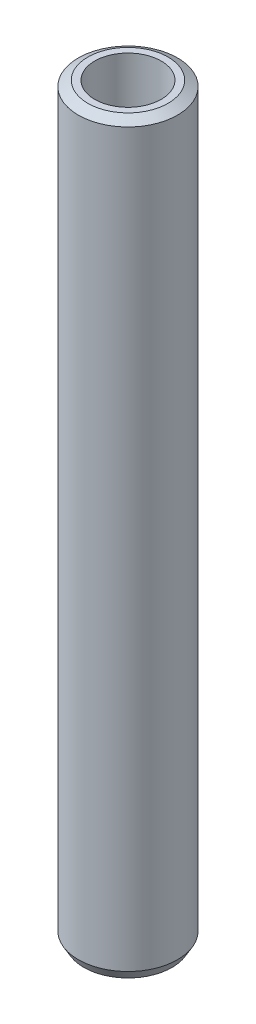
ISO-10303-21;
HEADER;
FILE_DESCRIPTION(('STEP AP214'),'2;1');
FILE_NAME('part.step','',(''),(''),'','','');
FILE_SCHEMA(('AUTOMOTIVE_DESIGN { 1 0 10303 214 1 1 1 1 }'));
ENDSEC;
DATA;
#1=APPLICATION_CONTEXT('core data for automotive mechanical design processes');
#2=APPLICATION_PROTOCOL_DEFINITION('international standard','automotive_design',2000,#1);
#3=PRODUCT_CONTEXT('',#1,'mechanical');
#4=PRODUCT('Part','Part','',(#3));
#5=PRODUCT_RELATED_PRODUCT_CATEGORY('part','',(#4));
#6=PRODUCT_DEFINITION_FORMATION('','',#4);
#7=PRODUCT_DEFINITION_CONTEXT('part definition',#1,'design');
#8=PRODUCT_DEFINITION('design','',#6,#7);
#9=PRODUCT_DEFINITION_SHAPE('','',#8);
#10=(LENGTH_UNIT() NAMED_UNIT(*) SI_UNIT(.MILLI.,.METRE.));
#11=(NAMED_UNIT(*) PLANE_ANGLE_UNIT() SI_UNIT($,.RADIAN.));
#12=(NAMED_UNIT(*) SI_UNIT($,.STERADIAN.) SOLID_ANGLE_UNIT());
#13=UNCERTAINTY_MEASURE_WITH_UNIT(LENGTH_MEASURE(1.E-05),#10,'distance_accuracy_value','');
#14=(GEOMETRIC_REPRESENTATION_CONTEXT(3) GLOBAL_UNCERTAINTY_ASSIGNED_CONTEXT((#13)) GLOBAL_UNIT_ASSIGNED_CONTEXT((#10,
#11,#12)) REPRESENTATION_CONTEXT('',''));
#15=CARTESIAN_POINT('',(0.,0.,0.));
#16=DIRECTION('',(0.,0.,1.));
#17=DIRECTION('',(1.,0.,0.));
#18=AXIS2_PLACEMENT_3D('',#15,#16,#17);
#19=CARTESIAN_POINT('',(0.,413.705561087987,0.));
#20=DIRECTION('',(0.,-1.,0.));
#21=DIRECTION('',(0.,0.,-1.));
#22=AXIS2_PLACEMENT_3D('',#19,#20,#21);
#23=CYLINDRICAL_SURFACE('',#22,27.5);
#24=CARTESIAN_POINT('',(0.,410.66934322682,0.));
#25=DIRECTION('',(0.,1.,0.));
#26=DIRECTION('',(0.,0.,1.));
#27=AXIS2_PLACEMENT_3D('',#24,#25,#26);
#28=CIRCLE('',#27,27.5);
#29=CARTESIAN_POINT('',(0.,410.66934322682,27.5));
#30=VERTEX_POINT('',#29);
#31=EDGE_CURVE('E50',#30,#30,#28,.F.);
#32=ORIENTED_EDGE('',*,*,#31,.T.);
#33=EDGE_LOOP('',(#32));
#34=FACE_BOUND('',#33,.T.);
#35=CARTESIAN_POINT('',(0.,5.25888359838927,0.));
#36=DIRECTION('',(0.,1.,0.));
#37=DIRECTION('',(0.,0.,1.));
#38=AXIS2_PLACEMENT_3D('',#35,#36,#37);
#39=CIRCLE('',#38,27.5);
#40=CARTESIAN_POINT('',(0.,5.25888359838927,27.5));
#41=VERTEX_POINT('',#40);
#42=EDGE_CURVE('E51',#41,#41,#39,.T.);
#43=ORIENTED_EDGE('',*,*,#42,.T.);
#44=EDGE_LOOP('',(#43));
#45=FACE_BOUND('',#44,.T.);
#46=ADVANCED_FACE('F39',(#34,#45),#23,.T.);
#47=CARTESIAN_POINT('',(0.,413.705561087987,0.));
#48=DIRECTION('',(0.,1.,0.));
#49=DIRECTION('',(0.,0.,1.));
#50=AXIS2_PLACEMENT_3D('',#47,#48,#49);
#51=PLANE('',#50);
#52=CARTESIAN_POINT('',(0.,413.705561087987,0.));
#53=DIRECTION('',(0.,1.,0.));
#54=DIRECTION('',(0.,0.,1.));
#55=AXIS2_PLACEMENT_3D('',#52,#53,#54);
#56=CIRCLE('',#55,22.2411164016109);
#57=CARTESIAN_POINT('',(0.,413.705561087987,22.2411164016109));
#58=VERTEX_POINT('',#57);
#59=EDGE_CURVE('E54',#58,#58,#56,.T.);
#60=ORIENTED_EDGE('',*,*,#59,.T.);
#61=EDGE_LOOP('',(#60));
#62=FACE_BOUND('',#61,.T.);
#63=CARTESIAN_POINT('',(0.,413.705561087987,0.));
#64=DIRECTION('',(0.,1.,0.));
#65=DIRECTION('',(0.,0.,1.));
#66=AXIS2_PLACEMENT_3D('',#63,#64,#65);
#67=CIRCLE('',#66,18.4349843335997);
#68=CARTESIAN_POINT('',(0.,413.705561087987,18.4349843335997));
#69=VERTEX_POINT('',#68);
#70=EDGE_CURVE('E58',#69,#69,#67,.T.);
#71=ORIENTED_EDGE('',*,*,#70,.F.);
#72=EDGE_LOOP('',(#71));
#73=FACE_BOUND('',#72,.T.);
#74=ADVANCED_FACE('F69',(#62,#73),#51,.T.);
#75=CARTESIAN_POINT('',(0.,0.,0.));
#76=DIRECTION('',(0.,1.,0.));
#77=DIRECTION('',(0.,0.,1.));
#78=AXIS2_PLACEMENT_3D('',#75,#76,#77);
#79=PLANE('',#78);
#80=CARTESIAN_POINT('',(0.,0.,0.));
#81=DIRECTION('',(0.,1.,0.));
#82=DIRECTION('',(0.,0.,1.));
#83=AXIS2_PLACEMENT_3D('',#80,#81,#82);
#84=CIRCLE('',#83,24.463782138833);
#85=CARTESIAN_POINT('',(0.,0.,24.463782138833));
#86=VERTEX_POINT('',#85);
#87=EDGE_CURVE('E10',#86,#86,#84,.F.);
#88=ORIENTED_EDGE('',*,*,#87,.T.);
#89=EDGE_LOOP('',(#88));
#90=FACE_BOUND('',#89,.T.);
#91=CARTESIAN_POINT('',(0.,0.,0.));
#92=DIRECTION('',(0.,1.,0.));
#93=DIRECTION('',(0.,0.,1.));
#94=AXIS2_PLACEMENT_3D('',#91,#92,#93);
#95=CIRCLE('',#94,18.4349843335997);
#96=CARTESIAN_POINT('',(0.,0.,18.4349843335997));
#97=VERTEX_POINT('',#96);
#98=EDGE_CURVE('E63',#97,#97,#95,.T.);
#99=ORIENTED_EDGE('',*,*,#98,.T.);
#100=EDGE_LOOP('',(#99));
#101=FACE_BOUND('',#100,.T.);
#102=ADVANCED_FACE('F75',(#90,#101),#79,.F.);
#103=CARTESIAN_POINT('',(0.,413.705561087987,0.));
#104=DIRECTION('',(0.,-1.,0.));
#105=DIRECTION('',(0.,0.,-1.));
#106=AXIS2_PLACEMENT_3D('',#103,#104,#105);
#107=CYLINDRICAL_SURFACE('',#106,18.4349843335997);
#108=ORIENTED_EDGE('',*,*,#70,.T.);
#109=EDGE_LOOP('',(#108));
#110=FACE_BOUND('',#109,.T.);
#111=ORIENTED_EDGE('',*,*,#98,.F.);
#112=EDGE_LOOP('',(#111));
#113=FACE_BOUND('',#112,.T.);
#114=ADVANCED_FACE('F70',(#110,#113),#107,.F.);
#115=CARTESIAN_POINT('',(0.,413.705561087987,0.));
#116=DIRECTION('',(0.,-1.,0.));
#117=DIRECTION('',(0.,0.,-1.));
#118=AXIS2_PLACEMENT_3D('',#115,#116,#117);
#119=CONICAL_SURFACE('',#118,22.2411164016109,1.04719755119659);
#120=ORIENTED_EDGE('',*,*,#31,.F.);
#121=EDGE_LOOP('',(#120));
#122=FACE_BOUND('',#121,.T.);
#123=ORIENTED_EDGE('',*,*,#59,.F.);
#124=EDGE_LOOP('',(#123));
#125=FACE_BOUND('',#124,.T.);
#126=ADVANCED_FACE('F81',(#122,#125),#119,.T.);
#127=CARTESIAN_POINT('',(0.,5.25888359838927,0.));
#128=DIRECTION('',(0.,1.,0.));
#129=DIRECTION('',(0.,0.,1.));
#130=AXIS2_PLACEMENT_3D('',#127,#128,#129);
#131=CONICAL_SURFACE('',#130,27.5,0.523598775598303);
#132=ORIENTED_EDGE('',*,*,#87,.F.);
#133=EDGE_LOOP('',(#132));
#134=FACE_BOUND('',#133,.T.);
#135=ORIENTED_EDGE('',*,*,#42,.F.);
#136=EDGE_LOOP('',(#135));
#137=FACE_BOUND('',#136,.T.);
#138=ADVANCED_FACE('F45',(#134,#137),#131,.T.);
#139=CLOSED_SHELL('',(#46,#74,#102,#114,#126,#138));
#140=MANIFOLD_SOLID_BREP('B2',#139);
#141=ADVANCED_BREP_SHAPE_REPRESENTATION('',(#18,#140),#14);
#142=SHAPE_DEFINITION_REPRESENTATION(#9,#141);
ENDSEC;
END-ISO-10303-21;
